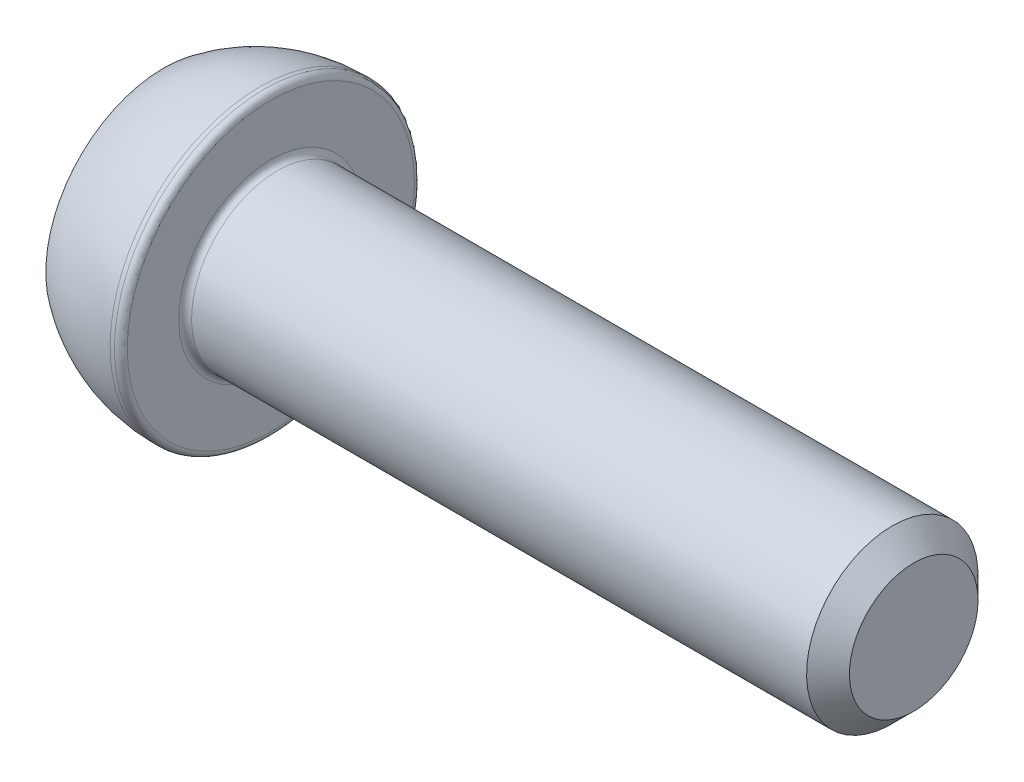
ISO-10303-21;
HEADER;
FILE_DESCRIPTION(('STEP AP214'),'2;1');
FILE_NAME('part.step','',(''),(''),'','','');
FILE_SCHEMA(('AUTOMOTIVE_DESIGN { 1 0 10303 214 1 1 1 1 }'));
ENDSEC;
DATA;
#1=APPLICATION_CONTEXT('core data for automotive mechanical design processes');
#2=APPLICATION_PROTOCOL_DEFINITION('international standard','automotive_design',2000,#1);
#3=PRODUCT_CONTEXT('',#1,'mechanical');
#4=PRODUCT('Part','Part','',(#3));
#5=PRODUCT_RELATED_PRODUCT_CATEGORY('part','',(#4));
#6=PRODUCT_DEFINITION_FORMATION('','',#4);
#7=PRODUCT_DEFINITION_CONTEXT('part definition',#1,'design');
#8=PRODUCT_DEFINITION('design','',#6,#7);
#9=PRODUCT_DEFINITION_SHAPE('','',#8);
#10=(LENGTH_UNIT() NAMED_UNIT(*) SI_UNIT(.MILLI.,.METRE.));
#11=(NAMED_UNIT(*) PLANE_ANGLE_UNIT() SI_UNIT($,.RADIAN.));
#12=(NAMED_UNIT(*) SI_UNIT($,.STERADIAN.) SOLID_ANGLE_UNIT());
#13=UNCERTAINTY_MEASURE_WITH_UNIT(LENGTH_MEASURE(1.E-05),#10,'distance_accuracy_value','');
#14=(GEOMETRIC_REPRESENTATION_CONTEXT(3) GLOBAL_UNCERTAINTY_ASSIGNED_CONTEXT((#13)) GLOBAL_UNIT_ASSIGNED_CONTEXT((#10,
#11,#12)) REPRESENTATION_CONTEXT('',''));
#15=CARTESIAN_POINT('',(0.,0.,0.));
#16=DIRECTION('',(0.,0.,1.));
#17=DIRECTION('',(1.,0.,0.));
#18=AXIS2_PLACEMENT_3D('',#15,#16,#17);
#19=CARTESIAN_POINT('',(0.,0.,0.));
#20=DIRECTION('',(-1.,0.,0.));
#21=DIRECTION('',(0.,-1.,0.));
#22=AXIS2_PLACEMENT_3D('',#19,#20,#21);
#23=PLANE('',#22);
#24=DIRECTION('',(0.,0.866025403784438,-0.5));
#25=VECTOR('',#24,1.);
#26=CARTESIAN_POINT('',(0.,0.,3.46410161513775));
#27=LINE('',#26,#25);
#28=CARTESIAN_POINT('',(0.,0.,3.46410161513775));
#29=VERTEX_POINT('',#28);
#30=CARTESIAN_POINT('',(0.,3.,1.73205080756888));
#31=VERTEX_POINT('',#30);
#32=EDGE_CURVE('E55',#29,#31,#27,.T.);
#33=ORIENTED_EDGE('',*,*,#32,.F.);
#34=DIRECTION('',(0.,0.866025403784438,0.5));
#35=VECTOR('',#34,1.);
#36=CARTESIAN_POINT('',(0.,-3.,1.73205080756888));
#37=LINE('',#36,#35);
#38=CARTESIAN_POINT('',(0.,-3.,1.73205080756888));
#39=VERTEX_POINT('',#38);
#40=EDGE_CURVE('E138',#39,#29,#37,.T.);
#41=ORIENTED_EDGE('',*,*,#40,.F.);
#42=DIRECTION('',(0.,0.,1.));
#43=VECTOR('',#42,1.);
#44=CARTESIAN_POINT('',(0.,-3.,-1.73205080756888));
#45=LINE('',#44,#43);
#46=CARTESIAN_POINT('',(0.,-3.,-1.73205080756888));
#47=VERTEX_POINT('',#46);
#48=EDGE_CURVE('E136',#47,#39,#45,.T.);
#49=ORIENTED_EDGE('',*,*,#48,.F.);
#50=DIRECTION('',(0.,-0.866025403784438,0.5));
#51=VECTOR('',#50,1.);
#52=CARTESIAN_POINT('',(0.,0.,-3.46410161513775));
#53=LINE('',#52,#51);
#54=CARTESIAN_POINT('',(0.,0.,-3.46410161513775));
#55=VERTEX_POINT('',#54);
#56=EDGE_CURVE('E103',#55,#47,#53,.T.);
#57=ORIENTED_EDGE('',*,*,#56,.F.);
#58=DIRECTION('',(0.,-0.866025403784439,-0.5));
#59=VECTOR('',#58,1.);
#60=CARTESIAN_POINT('',(0.,3.,-1.73205080756888));
#61=LINE('',#60,#59);
#62=CARTESIAN_POINT('',(0.,3.,-1.73205080756888));
#63=VERTEX_POINT('',#62);
#64=EDGE_CURVE('E132',#63,#55,#61,.T.);
#65=ORIENTED_EDGE('',*,*,#64,.F.);
#66=DIRECTION('',(0.,0.,-1.));
#67=VECTOR('',#66,1.);
#68=CARTESIAN_POINT('',(0.,3.,1.73205080756888));
#69=LINE('',#68,#67);
#70=EDGE_CURVE('E129',#31,#63,#69,.T.);
#71=ORIENTED_EDGE('',*,*,#70,.F.);
#72=EDGE_LOOP('',(#33,#41,#49,#57,#65,#71));
#73=FACE_BOUND('',#72,.T.);
#74=CARTESIAN_POINT('',(0.,0.,0.));
#75=DIRECTION('',(1.,0.,0.));
#76=DIRECTION('',(0.,1.,0.));
#77=AXIS2_PLACEMENT_3D('',#74,#75,#76);
#78=CIRCLE('',#77,5.5);
#79=CARTESIAN_POINT('',(0.,5.5,0.));
#80=VERTEX_POINT('',#79);
#81=EDGE_CURVE('E150',#80,#80,#78,.T.);
#82=ORIENTED_EDGE('',*,*,#81,.F.);
#83=EDGE_LOOP('',(#82));
#84=FACE_BOUND('',#83,.T.);
#85=ADVANCED_FACE('F39',(#73,#84),#23,.T.);
#86=CARTESIAN_POINT('',(4.5,0.,0.));
#87=DIRECTION('',(1.,0.,0.));
#88=DIRECTION('',(0.,1.,0.));
#89=AXIS2_PLACEMENT_3D('',#86,#87,#88);
#90=DEGENERATE_TOROIDAL_SURFACE('',#89,0.500000000000003,7.5,.F.);
#91=ORIENTED_EDGE('',*,*,#81,.T.);
#92=EDGE_LOOP('',(#91));
#93=FACE_BOUND('',#92,.T.);
#94=CARTESIAN_POINT('',(4.5,0.,0.));
#95=DIRECTION('',(1.,0.,0.));
#96=DIRECTION('',(0.,1.,0.));
#97=AXIS2_PLACEMENT_3D('',#94,#95,#96);
#98=CIRCLE('',#97,7.);
#99=CARTESIAN_POINT('',(4.5,7.,0.));
#100=VERTEX_POINT('',#99);
#101=EDGE_CURVE('E142',#100,#100,#98,.T.);
#102=ORIENTED_EDGE('',*,*,#101,.F.);
#103=EDGE_LOOP('',(#102));
#104=FACE_BOUND('',#103,.T.);
#105=ADVANCED_FACE('F179',(#93,#104),#90,.F.);
#106=CARTESIAN_POINT('',(35.,0.,0.));
#107=DIRECTION('',(1.,0.,0.));
#108=DIRECTION('',(0.,1.,0.));
#109=AXIS2_PLACEMENT_3D('',#106,#107,#108);
#110=CYLINDRICAL_SURFACE('',#109,6.99999999999999);
#111=CARTESIAN_POINT('',(4.7,0.,0.));
#112=DIRECTION('',(1.,0.,0.));
#113=DIRECTION('',(0.,1.,0.));
#114=AXIS2_PLACEMENT_3D('',#111,#112,#113);
#115=CIRCLE('',#114,6.99999999999999);
#116=CARTESIAN_POINT('',(4.7,7.,0.));
#117=VERTEX_POINT('',#116);
#118=EDGE_CURVE('E162',#117,#117,#115,.F.);
#119=ORIENTED_EDGE('',*,*,#118,.T.);
#120=EDGE_LOOP('',(#119));
#121=FACE_BOUND('',#120,.T.);
#122=ORIENTED_EDGE('',*,*,#101,.T.);
#123=EDGE_LOOP('',(#122));
#124=FACE_BOUND('',#123,.T.);
#125=ADVANCED_FACE('F185',(#121,#124),#110,.T.);
#126=CARTESIAN_POINT('',(5.,7.,0.));
#127=DIRECTION('',(1.,0.,0.));
#128=DIRECTION('',(0.,1.,0.));
#129=AXIS2_PLACEMENT_3D('',#126,#127,#128);
#130=PLANE('',#129);
#131=CARTESIAN_POINT('',(5.,0.,0.));
#132=DIRECTION('',(1.,0.,0.));
#133=DIRECTION('',(0.,1.,0.));
#134=AXIS2_PLACEMENT_3D('',#131,#132,#133);
#135=CIRCLE('',#134,4.29999999999999);
#136=CARTESIAN_POINT('',(5.,4.29999999999999,0.));
#137=VERTEX_POINT('',#136);
#138=EDGE_CURVE('E159',#137,#137,#135,.F.);
#139=ORIENTED_EDGE('',*,*,#138,.T.);
#140=EDGE_LOOP('',(#139));
#141=FACE_BOUND('',#140,.T.);
#142=CARTESIAN_POINT('',(5.,0.,0.));
#143=DIRECTION('',(1.,0.,0.));
#144=DIRECTION('',(0.,1.,0.));
#145=AXIS2_PLACEMENT_3D('',#142,#143,#144);
#146=CIRCLE('',#145,6.69999999999999);
#147=CARTESIAN_POINT('',(5.,6.7,0.));
#148=VERTEX_POINT('',#147);
#149=EDGE_CURVE('E156',#148,#148,#146,.T.);
#150=ORIENTED_EDGE('',*,*,#149,.T.);
#151=EDGE_LOOP('',(#150));
#152=FACE_BOUND('',#151,.T.);
#153=ADVANCED_FACE('F204',(#141,#152),#130,.T.);
#154=CARTESIAN_POINT('',(35.,0.,0.));
#155=DIRECTION('',(1.,0.,0.));
#156=DIRECTION('',(0.,1.,0.));
#157=AXIS2_PLACEMENT_3D('',#154,#155,#156);
#158=CYLINDRICAL_SURFACE('',#157,3.99999999999999);
#159=CARTESIAN_POINT('',(34.,0.,0.));
#160=DIRECTION('',(1.,0.,0.));
#161=DIRECTION('',(0.,1.,0.));
#162=AXIS2_PLACEMENT_3D('',#159,#160,#161);
#163=CIRCLE('',#162,3.99999999999999);
#164=CARTESIAN_POINT('',(34.,4.,0.));
#165=VERTEX_POINT('',#164);
#166=EDGE_CURVE('E11',#165,#165,#163,.F.);
#167=ORIENTED_EDGE('',*,*,#166,.T.);
#168=EDGE_LOOP('',(#167));
#169=FACE_BOUND('',#168,.T.);
#170=CARTESIAN_POINT('',(5.3,0.,0.));
#171=DIRECTION('',(1.,0.,0.));
#172=DIRECTION('',(0.,1.,0.));
#173=AXIS2_PLACEMENT_3D('',#170,#171,#172);
#174=CIRCLE('',#173,3.99999999999999);
#175=CARTESIAN_POINT('',(5.3,3.99999999999999,0.));
#176=VERTEX_POINT('',#175);
#177=EDGE_CURVE('E153',#176,#176,#174,.T.);
#178=ORIENTED_EDGE('',*,*,#177,.T.);
#179=EDGE_LOOP('',(#178));
#180=FACE_BOUND('',#179,.T.);
#181=ADVANCED_FACE('F202',(#169,#180),#158,.T.);
#182=CARTESIAN_POINT('',(35.,4.,0.));
#183=DIRECTION('',(1.,0.,0.));
#184=DIRECTION('',(0.,1.,0.));
#185=AXIS2_PLACEMENT_3D('',#182,#183,#184);
#186=PLANE('',#185);
#187=CARTESIAN_POINT('',(35.,0.,0.));
#188=DIRECTION('',(1.,0.,0.));
#189=DIRECTION('',(0.,1.,0.));
#190=AXIS2_PLACEMENT_3D('',#187,#188,#189);
#191=CIRCLE('',#190,2.99999999999998);
#192=CARTESIAN_POINT('',(35.,2.99999999999999,0.));
#193=VERTEX_POINT('',#192);
#194=EDGE_CURVE('E48',#193,#193,#191,.T.);
#195=ORIENTED_EDGE('',*,*,#194,.T.);
#196=EDGE_LOOP('',(#195));
#197=FACE_BOUND('',#196,.T.);
#198=ADVANCED_FACE('F167',(#197),#186,.T.);
#199=CARTESIAN_POINT('',(3.,0.,3.46410161513775));
#200=DIRECTION('',(0.,0.5,0.866025403784439));
#201=DIRECTION('',(0.,-0.866025403784439,0.5));
#202=AXIS2_PLACEMENT_3D('',#199,#200,#201);
#203=PLANE('',#202);
#204=ORIENTED_EDGE('',*,*,#32,.T.);
#205=DIRECTION('',(-1.,0.,0.));
#206=VECTOR('',#205,1.);
#207=CARTESIAN_POINT('',(3.,3.,1.73205080756888));
#208=LINE('',#207,#206);
#209=CARTESIAN_POINT('',(3.,3.,1.73205080756888));
#210=VERTEX_POINT('',#209);
#211=EDGE_CURVE('E85',#210,#31,#208,.T.);
#212=ORIENTED_EDGE('',*,*,#211,.F.);
#213=DIRECTION('',(0.,0.866025403784438,-0.5));
#214=VECTOR('',#213,1.);
#215=CARTESIAN_POINT('',(3.,0.,3.46410161513775));
#216=LINE('',#215,#214);
#217=CARTESIAN_POINT('',(3.,0.,3.46410161513775));
#218=VERTEX_POINT('',#217);
#219=EDGE_CURVE('E140',#218,#210,#216,.T.);
#220=ORIENTED_EDGE('',*,*,#219,.F.);
#221=DIRECTION('',(-1.,0.,0.));
#222=VECTOR('',#221,1.);
#223=CARTESIAN_POINT('',(3.,0.,3.46410161513775));
#224=LINE('',#223,#222);
#225=EDGE_CURVE('E63',#218,#29,#224,.T.);
#226=ORIENTED_EDGE('',*,*,#225,.T.);
#227=EDGE_LOOP('',(#204,#212,#220,#226));
#228=FACE_BOUND('',#227,.T.);
#229=ADVANCED_FACE('F211',(#228),#203,.F.);
#230=CARTESIAN_POINT('',(3.,-3.,1.73205080756888));
#231=DIRECTION('',(0.,-0.5,0.866025403784439));
#232=DIRECTION('',(0.,-0.866025403784439,-0.5));
#233=AXIS2_PLACEMENT_3D('',#230,#231,#232);
#234=PLANE('',#233);
#235=ORIENTED_EDGE('',*,*,#40,.T.);
#236=ORIENTED_EDGE('',*,*,#225,.F.);
#237=DIRECTION('',(0.,0.866025403784438,0.5));
#238=VECTOR('',#237,1.);
#239=CARTESIAN_POINT('',(3.,-3.,1.73205080756888));
#240=LINE('',#239,#238);
#241=CARTESIAN_POINT('',(3.,-3.,1.73205080756888));
#242=VERTEX_POINT('',#241);
#243=EDGE_CURVE('E115',#242,#218,#240,.T.);
#244=ORIENTED_EDGE('',*,*,#243,.F.);
#245=DIRECTION('',(-1.,0.,0.));
#246=VECTOR('',#245,1.);
#247=CARTESIAN_POINT('',(3.,-3.,1.73205080756888));
#248=LINE('',#247,#246);
#249=EDGE_CURVE('E107',#242,#39,#248,.T.);
#250=ORIENTED_EDGE('',*,*,#249,.T.);
#251=EDGE_LOOP('',(#235,#236,#244,#250));
#252=FACE_BOUND('',#251,.T.);
#253=ADVANCED_FACE('F270',(#252),#234,.F.);
#254=CARTESIAN_POINT('',(3.,-3.,-1.73205080756888));
#255=DIRECTION('',(0.,-1.,0.));
#256=DIRECTION('',(0.,0.,-1.));
#257=AXIS2_PLACEMENT_3D('',#254,#255,#256);
#258=PLANE('',#257);
#259=ORIENTED_EDGE('',*,*,#48,.T.);
#260=ORIENTED_EDGE('',*,*,#249,.F.);
#261=DIRECTION('',(0.,0.,1.));
#262=VECTOR('',#261,1.);
#263=CARTESIAN_POINT('',(3.,-3.,-1.73205080756888));
#264=LINE('',#263,#262);
#265=CARTESIAN_POINT('',(3.,-3.,-1.73205080756888));
#266=VERTEX_POINT('',#265);
#267=EDGE_CURVE('E111',#266,#242,#264,.T.);
#268=ORIENTED_EDGE('',*,*,#267,.F.);
#269=DIRECTION('',(-1.,0.,0.));
#270=VECTOR('',#269,1.);
#271=CARTESIAN_POINT('',(3.,-3.,-1.73205080756888));
#272=LINE('',#271,#270);
#273=EDGE_CURVE('E96',#266,#47,#272,.T.);
#274=ORIENTED_EDGE('',*,*,#273,.T.);
#275=EDGE_LOOP('',(#259,#260,#268,#274));
#276=FACE_BOUND('',#275,.T.);
#277=ADVANCED_FACE('F112',(#276),#258,.F.);
#278=CARTESIAN_POINT('',(3.,0.,-3.46410161513775));
#279=DIRECTION('',(0.,-0.5,-0.866025403784439));
#280=DIRECTION('',(0.,0.866025403784439,-0.5));
#281=AXIS2_PLACEMENT_3D('',#278,#279,#280);
#282=PLANE('',#281);
#283=ORIENTED_EDGE('',*,*,#56,.T.);
#284=ORIENTED_EDGE('',*,*,#273,.F.);
#285=DIRECTION('',(0.,-0.866025403784438,0.5));
#286=VECTOR('',#285,1.);
#287=CARTESIAN_POINT('',(3.,0.,-3.46410161513775));
#288=LINE('',#287,#286);
#289=CARTESIAN_POINT('',(3.,0.,-3.46410161513775));
#290=VERTEX_POINT('',#289);
#291=EDGE_CURVE('E100',#290,#266,#288,.T.);
#292=ORIENTED_EDGE('',*,*,#291,.F.);
#293=DIRECTION('',(-1.,0.,0.));
#294=VECTOR('',#293,1.);
#295=CARTESIAN_POINT('',(3.,0.,-3.46410161513775));
#296=LINE('',#295,#294);
#297=EDGE_CURVE('E108',#290,#55,#296,.T.);
#298=ORIENTED_EDGE('',*,*,#297,.T.);
#299=EDGE_LOOP('',(#283,#284,#292,#298));
#300=FACE_BOUND('',#299,.T.);
#301=ADVANCED_FACE('F98',(#300),#282,.F.);
#302=CARTESIAN_POINT('',(3.,3.,-1.73205080756888));
#303=DIRECTION('',(0.,0.5,-0.866025403784439));
#304=DIRECTION('',(0.,0.866025403784439,0.5));
#305=AXIS2_PLACEMENT_3D('',#302,#303,#304);
#306=PLANE('',#305);
#307=ORIENTED_EDGE('',*,*,#64,.T.);
#308=ORIENTED_EDGE('',*,*,#297,.F.);
#309=DIRECTION('',(0.,-0.866025403784439,-0.5));
#310=VECTOR('',#309,1.);
#311=CARTESIAN_POINT('',(3.,3.,-1.73205080756888));
#312=LINE('',#311,#310);
#313=CARTESIAN_POINT('',(3.,3.,-1.73205080756888));
#314=VERTEX_POINT('',#313);
#315=EDGE_CURVE('E121',#314,#290,#312,.T.);
#316=ORIENTED_EDGE('',*,*,#315,.F.);
#317=DIRECTION('',(-1.,0.,0.));
#318=VECTOR('',#317,1.);
#319=CARTESIAN_POINT('',(3.,3.,-1.73205080756888));
#320=LINE('',#319,#318);
#321=EDGE_CURVE('E145',#314,#63,#320,.T.);
#322=ORIENTED_EDGE('',*,*,#321,.T.);
#323=EDGE_LOOP('',(#307,#308,#316,#322));
#324=FACE_BOUND('',#323,.T.);
#325=ADVANCED_FACE('F287',(#324),#306,.F.);
#326=CARTESIAN_POINT('',(3.,3.,1.73205080756888));
#327=DIRECTION('',(0.,1.,0.));
#328=DIRECTION('',(0.,0.,1.));
#329=AXIS2_PLACEMENT_3D('',#326,#327,#328);
#330=PLANE('',#329);
#331=ORIENTED_EDGE('',*,*,#70,.T.);
#332=ORIENTED_EDGE('',*,*,#321,.F.);
#333=DIRECTION('',(0.,0.,-1.));
#334=VECTOR('',#333,1.);
#335=CARTESIAN_POINT('',(3.,3.,1.73205080756888));
#336=LINE('',#335,#334);
#337=EDGE_CURVE('E123',#210,#314,#336,.T.);
#338=ORIENTED_EDGE('',*,*,#337,.F.);
#339=ORIENTED_EDGE('',*,*,#211,.T.);
#340=EDGE_LOOP('',(#331,#332,#338,#339));
#341=FACE_BOUND('',#340,.T.);
#342=ADVANCED_FACE('F196',(#341),#330,.F.);
#343=CARTESIAN_POINT('',(3.,0.,0.));
#344=DIRECTION('',(-1.,0.,0.));
#345=DIRECTION('',(0.,0.,1.));
#346=AXIS2_PLACEMENT_3D('',#343,#344,#345);
#347=PLANE('',#346);
#348=ORIENTED_EDGE('',*,*,#219,.T.);
#349=ORIENTED_EDGE('',*,*,#337,.T.);
#350=ORIENTED_EDGE('',*,*,#315,.T.);
#351=ORIENTED_EDGE('',*,*,#291,.T.);
#352=ORIENTED_EDGE('',*,*,#267,.T.);
#353=ORIENTED_EDGE('',*,*,#243,.T.);
#354=EDGE_LOOP('',(#348,#349,#350,#351,#352,#353));
#355=FACE_BOUND('',#354,.T.);
#356=ADVANCED_FACE('F118',(#355),#347,.T.);
#357=CARTESIAN_POINT('',(5.3,0.,0.));
#358=DIRECTION('',(1.,0.,0.));
#359=DIRECTION('',(0.,1.,0.));
#360=AXIS2_PLACEMENT_3D('',#357,#358,#359);
#361=TOROIDAL_SURFACE('',#360,4.29999999999999,0.3);
#362=ORIENTED_EDGE('',*,*,#138,.F.);
#363=EDGE_LOOP('',(#362));
#364=FACE_BOUND('',#363,.T.);
#365=ORIENTED_EDGE('',*,*,#177,.F.);
#366=EDGE_LOOP('',(#365));
#367=FACE_BOUND('',#366,.T.);
#368=ADVANCED_FACE('F175',(#364,#367),#361,.F.);
#369=CARTESIAN_POINT('',(4.7,0.,0.));
#370=DIRECTION('',(1.,0.,0.));
#371=DIRECTION('',(0.,1.,0.));
#372=AXIS2_PLACEMENT_3D('',#369,#370,#371);
#373=TOROIDAL_SURFACE('',#372,6.69999999999999,0.3);
#374=ORIENTED_EDGE('',*,*,#118,.F.);
#375=EDGE_LOOP('',(#374));
#376=FACE_BOUND('',#375,.T.);
#377=ORIENTED_EDGE('',*,*,#149,.F.);
#378=EDGE_LOOP('',(#377));
#379=FACE_BOUND('',#378,.T.);
#380=ADVANCED_FACE('F170',(#376,#379),#373,.T.);
#381=CARTESIAN_POINT('',(35.,0.,0.));
#382=DIRECTION('',(-1.,0.,0.));
#383=DIRECTION('',(0.,-1.,0.));
#384=AXIS2_PLACEMENT_3D('',#381,#382,#383);
#385=CONICAL_SURFACE('',#384,2.99999999999998,0.785398163397442);
#386=ORIENTED_EDGE('',*,*,#166,.F.);
#387=EDGE_LOOP('',(#386));
#388=FACE_BOUND('',#387,.T.);
#389=ORIENTED_EDGE('',*,*,#194,.F.);
#390=EDGE_LOOP('',(#389));
#391=FACE_BOUND('',#390,.T.);
#392=ADVANCED_FACE('F42',(#388,#391),#385,.T.);
#393=CLOSED_SHELL('',(#85,#105,#125,#153,#181,#198,#229,#253,#277,#301,#325,#342,#356,#368,#380,#392));
#394=MANIFOLD_SOLID_BREP('B2',#393);
#395=ADVANCED_BREP_SHAPE_REPRESENTATION('',(#18,#394),#14);
#396=SHAPE_DEFINITION_REPRESENTATION(#9,#395);
ENDSEC;
END-ISO-10303-21;
